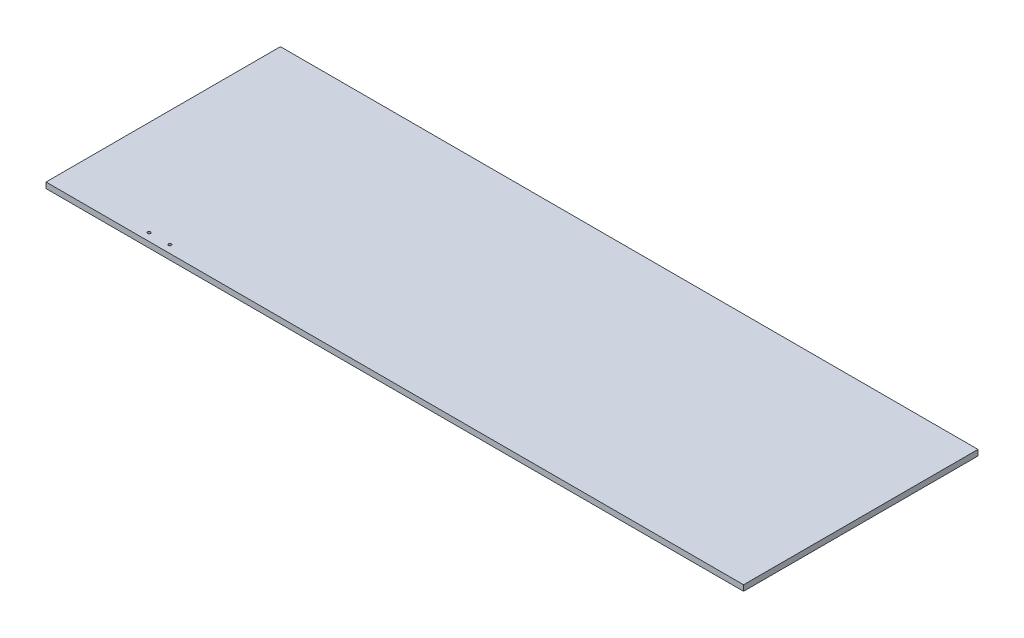
ISO-10303-21;
HEADER;
FILE_DESCRIPTION(('STEP AP214'),'2;1');
FILE_NAME('part.step','',(''),(''),'','','');
FILE_SCHEMA(('AUTOMOTIVE_DESIGN { 1 0 10303 214 1 1 1 1 }'));
ENDSEC;
DATA;
#1=APPLICATION_CONTEXT('core data for automotive mechanical design processes');
#2=APPLICATION_PROTOCOL_DEFINITION('international standard','automotive_design',2000,#1);
#3=PRODUCT_CONTEXT('',#1,'mechanical');
#4=PRODUCT('Part','Part','',(#3));
#5=PRODUCT_RELATED_PRODUCT_CATEGORY('part','',(#4));
#6=PRODUCT_DEFINITION_FORMATION('','',#4);
#7=PRODUCT_DEFINITION_CONTEXT('part definition',#1,'design');
#8=PRODUCT_DEFINITION('design','',#6,#7);
#9=PRODUCT_DEFINITION_SHAPE('','',#8);
#10=(LENGTH_UNIT() NAMED_UNIT(*) SI_UNIT(.MILLI.,.METRE.));
#11=(NAMED_UNIT(*) PLANE_ANGLE_UNIT() SI_UNIT($,.RADIAN.));
#12=(NAMED_UNIT(*) SI_UNIT($,.STERADIAN.) SOLID_ANGLE_UNIT());
#13=UNCERTAINTY_MEASURE_WITH_UNIT(LENGTH_MEASURE(1.E-05),#10,'distance_accuracy_value','');
#14=(GEOMETRIC_REPRESENTATION_CONTEXT(3) GLOBAL_UNCERTAINTY_ASSIGNED_CONTEXT((#13)) GLOBAL_UNIT_ASSIGNED_CONTEXT((#10,
#11,#12)) REPRESENTATION_CONTEXT('',''));
#15=CARTESIAN_POINT('',(0.,0.,0.));
#16=DIRECTION('',(0.,0.,1.));
#17=DIRECTION('',(1.,0.,0.));
#18=AXIS2_PLACEMENT_3D('',#15,#16,#17);
#19=CARTESIAN_POINT('',(0.,10.,-410.));
#20=DIRECTION('',(0.,0.,-1.));
#21=DIRECTION('',(-1.,0.,0.));
#22=AXIS2_PLACEMENT_3D('',#19,#20,#21);
#23=PLANE('',#22);
#24=DIRECTION('',(1.,0.,0.));
#25=VECTOR('',#24,1.);
#26=CARTESIAN_POINT('',(0.,0.,-410.));
#27=LINE('',#26,#25);
#28=CARTESIAN_POINT('',(0.,0.,-410.));
#29=VERTEX_POINT('',#28);
#30=CARTESIAN_POINT('',(1220.,0.,-410.));
#31=VERTEX_POINT('',#30);
#32=EDGE_CURVE('E99',#29,#31,#27,.T.);
#33=ORIENTED_EDGE('',*,*,#32,.F.);
#34=DIRECTION('',(0.,-1.,0.));
#35=VECTOR('',#34,1.);
#36=CARTESIAN_POINT('',(0.,10.,-410.));
#37=LINE('',#36,#35);
#38=CARTESIAN_POINT('',(0.,10.,-410.));
#39=VERTEX_POINT('',#38);
#40=EDGE_CURVE('E11',#39,#29,#37,.T.);
#41=ORIENTED_EDGE('',*,*,#40,.F.);
#42=DIRECTION('',(1.,0.,0.));
#43=VECTOR('',#42,1.);
#44=CARTESIAN_POINT('',(0.,10.,-410.));
#45=LINE('',#44,#43);
#46=CARTESIAN_POINT('',(1220.,10.,-410.));
#47=VERTEX_POINT('',#46);
#48=EDGE_CURVE('E93',#39,#47,#45,.T.);
#49=ORIENTED_EDGE('',*,*,#48,.T.);
#50=DIRECTION('',(0.,-1.,0.));
#51=VECTOR('',#50,1.);
#52=CARTESIAN_POINT('',(1220.,10.,-410.));
#53=LINE('',#52,#51);
#54=EDGE_CURVE('E36',#47,#31,#53,.T.);
#55=ORIENTED_EDGE('',*,*,#54,.T.);
#56=EDGE_LOOP('',(#33,#41,#49,#55));
#57=FACE_BOUND('',#56,.T.);
#58=ADVANCED_FACE('F33',(#57),#23,.T.);
#59=CARTESIAN_POINT('',(0.,10.,-410.));
#60=DIRECTION('',(1.,0.,0.));
#61=DIRECTION('',(0.,0.,-1.));
#62=AXIS2_PLACEMENT_3D('',#59,#60,#61);
#63=PLANE('',#62);
#64=DIRECTION('',(0.,0.,1.));
#65=VECTOR('',#64,1.);
#66=CARTESIAN_POINT('',(0.,0.,-410.));
#67=LINE('',#66,#65);
#68=CARTESIAN_POINT('',(0.,0.,0.));
#69=VERTEX_POINT('',#68);
#70=EDGE_CURVE('E66',#29,#69,#67,.T.);
#71=ORIENTED_EDGE('',*,*,#70,.T.);
#72=DIRECTION('',(0.,-1.,0.));
#73=VECTOR('',#72,1.);
#74=CARTESIAN_POINT('',(0.,10.,0.));
#75=LINE('',#74,#73);
#76=CARTESIAN_POINT('',(0.,10.,0.));
#77=VERTEX_POINT('',#76);
#78=EDGE_CURVE('E42',#77,#69,#75,.T.);
#79=ORIENTED_EDGE('',*,*,#78,.F.);
#80=DIRECTION('',(0.,0.,1.));
#81=VECTOR('',#80,1.);
#82=CARTESIAN_POINT('',(0.,10.,-410.));
#83=LINE('',#82,#81);
#84=EDGE_CURVE('E83',#39,#77,#83,.T.);
#85=ORIENTED_EDGE('',*,*,#84,.F.);
#86=ORIENTED_EDGE('',*,*,#40,.T.);
#87=EDGE_LOOP('',(#71,#79,#85,#86));
#88=FACE_BOUND('',#87,.T.);
#89=ADVANCED_FACE('F110',(#88),#63,.F.);
#90=CARTESIAN_POINT('',(0.,10.,0.));
#91=DIRECTION('',(0.,0.,-1.));
#92=DIRECTION('',(-1.,0.,0.));
#93=AXIS2_PLACEMENT_3D('',#90,#91,#92);
#94=PLANE('',#93);
#95=DIRECTION('',(1.,0.,0.));
#96=VECTOR('',#95,1.);
#97=CARTESIAN_POINT('',(0.,0.,0.));
#98=LINE('',#97,#96);
#99=CARTESIAN_POINT('',(1220.,0.,0.));
#100=VERTEX_POINT('',#99);
#101=EDGE_CURVE('E90',#69,#100,#98,.T.);
#102=ORIENTED_EDGE('',*,*,#101,.T.);
#103=DIRECTION('',(0.,-1.,0.));
#104=VECTOR('',#103,1.);
#105=CARTESIAN_POINT('',(1220.,10.,0.));
#106=LINE('',#105,#104);
#107=CARTESIAN_POINT('',(1220.,10.,0.));
#108=VERTEX_POINT('',#107);
#109=EDGE_CURVE('E87',#108,#100,#106,.T.);
#110=ORIENTED_EDGE('',*,*,#109,.F.);
#111=DIRECTION('',(1.,0.,0.));
#112=VECTOR('',#111,1.);
#113=CARTESIAN_POINT('',(0.,10.,0.));
#114=LINE('',#113,#112);
#115=EDGE_CURVE('E78',#77,#108,#114,.T.);
#116=ORIENTED_EDGE('',*,*,#115,.F.);
#117=ORIENTED_EDGE('',*,*,#78,.T.);
#118=EDGE_LOOP('',(#102,#110,#116,#117));
#119=FACE_BOUND('',#118,.T.);
#120=ADVANCED_FACE('F88',(#119),#94,.F.);
#121=CARTESIAN_POINT('',(1220.,10.,-410.));
#122=DIRECTION('',(1.,0.,0.));
#123=DIRECTION('',(0.,0.,-1.));
#124=AXIS2_PLACEMENT_3D('',#121,#122,#123);
#125=PLANE('',#124);
#126=DIRECTION('',(0.,0.,1.));
#127=VECTOR('',#126,1.);
#128=CARTESIAN_POINT('',(1220.,0.,-410.));
#129=LINE('',#128,#127);
#130=EDGE_CURVE('E102',#31,#100,#129,.T.);
#131=ORIENTED_EDGE('',*,*,#130,.F.);
#132=ORIENTED_EDGE('',*,*,#54,.F.);
#133=DIRECTION('',(0.,0.,1.));
#134=VECTOR('',#133,1.);
#135=CARTESIAN_POINT('',(1220.,10.,-410.));
#136=LINE('',#135,#134);
#137=EDGE_CURVE('E82',#47,#108,#136,.T.);
#138=ORIENTED_EDGE('',*,*,#137,.T.);
#139=ORIENTED_EDGE('',*,*,#109,.T.);
#140=EDGE_LOOP('',(#131,#132,#138,#139));
#141=FACE_BOUND('',#140,.T.);
#142=ADVANCED_FACE('F92',(#141),#125,.T.);
#143=CARTESIAN_POINT('',(0.,10.,0.));
#144=DIRECTION('',(0.,-1.,0.));
#145=DIRECTION('',(0.,0.,-1.));
#146=AXIS2_PLACEMENT_3D('',#143,#144,#145);
#147=PLANE('',#146);
#148=CARTESIAN_POINT('',(166.8,10.,-13.5));
#149=DIRECTION('',(0.,1.,0.));
#150=DIRECTION('',(0.,0.,1.));
#151=AXIS2_PLACEMENT_3D('',#148,#149,#150);
#152=CIRCLE('',#151,2.5);
#153=CARTESIAN_POINT('',(166.8,10.,-11.));
#154=VERTEX_POINT('',#153);
#155=EDGE_CURVE('E103',#154,#154,#152,.T.);
#156=ORIENTED_EDGE('',*,*,#155,.F.);
#157=EDGE_LOOP('',(#156));
#158=FACE_BOUND('',#157,.T.);
#159=CARTESIAN_POINT('',(203.3,10.,-13.5));
#160=DIRECTION('',(0.,1.,0.));
#161=DIRECTION('',(0.,0.,1.));
#162=AXIS2_PLACEMENT_3D('',#159,#160,#161);
#163=CIRCLE('',#162,2.5);
#164=CARTESIAN_POINT('',(203.3,10.,-11.));
#165=VERTEX_POINT('',#164);
#166=EDGE_CURVE('E147',#165,#165,#163,.T.);
#167=ORIENTED_EDGE('',*,*,#166,.F.);
#168=EDGE_LOOP('',(#167));
#169=FACE_BOUND('',#168,.T.);
#170=ORIENTED_EDGE('',*,*,#48,.F.);
#171=ORIENTED_EDGE('',*,*,#84,.T.);
#172=ORIENTED_EDGE('',*,*,#115,.T.);
#173=ORIENTED_EDGE('',*,*,#137,.F.);
#174=EDGE_LOOP('',(#170,#171,#172,#173));
#175=FACE_BOUND('',#174,.T.);
#176=ADVANCED_FACE('F81',(#158,#169,#175),#147,.F.);
#177=CARTESIAN_POINT('',(0.,0.,0.));
#178=DIRECTION('',(0.,-1.,0.));
#179=DIRECTION('',(0.,0.,-1.));
#180=AXIS2_PLACEMENT_3D('',#177,#178,#179);
#181=PLANE('',#180);
#182=CARTESIAN_POINT('',(166.8,0.,-13.5));
#183=DIRECTION('',(0.,1.,0.));
#184=DIRECTION('',(0.,0.,1.));
#185=AXIS2_PLACEMENT_3D('',#182,#183,#184);
#186=CIRCLE('',#185,2.5);
#187=CARTESIAN_POINT('',(166.8,0.,-11.));
#188=VERTEX_POINT('',#187);
#189=EDGE_CURVE('E146',#188,#188,#186,.T.);
#190=ORIENTED_EDGE('',*,*,#189,.T.);
#191=EDGE_LOOP('',(#190));
#192=FACE_BOUND('',#191,.T.);
#193=CARTESIAN_POINT('',(203.3,0.,-13.5));
#194=DIRECTION('',(0.,1.,0.));
#195=DIRECTION('',(0.,0.,1.));
#196=AXIS2_PLACEMENT_3D('',#193,#194,#195);
#197=CIRCLE('',#196,2.5);
#198=CARTESIAN_POINT('',(203.3,0.,-11.));
#199=VERTEX_POINT('',#198);
#200=EDGE_CURVE('E151',#199,#199,#197,.T.);
#201=ORIENTED_EDGE('',*,*,#200,.T.);
#202=EDGE_LOOP('',(#201));
#203=FACE_BOUND('',#202,.T.);
#204=ORIENTED_EDGE('',*,*,#32,.T.);
#205=ORIENTED_EDGE('',*,*,#130,.T.);
#206=ORIENTED_EDGE('',*,*,#101,.F.);
#207=ORIENTED_EDGE('',*,*,#70,.F.);
#208=EDGE_LOOP('',(#204,#205,#206,#207));
#209=FACE_BOUND('',#208,.T.);
#210=ADVANCED_FACE('F108',(#192,#203,#209),#181,.T.);
#211=CARTESIAN_POINT('',(203.3,10.,-13.5));
#212=DIRECTION('',(0.,-1.,0.));
#213=DIRECTION('',(0.,0.,-1.));
#214=AXIS2_PLACEMENT_3D('',#211,#212,#213);
#215=CYLINDRICAL_SURFACE('',#214,2.5);
#216=ORIENTED_EDGE('',*,*,#166,.T.);
#217=EDGE_LOOP('',(#216));
#218=FACE_BOUND('',#217,.T.);
#219=ORIENTED_EDGE('',*,*,#200,.F.);
#220=EDGE_LOOP('',(#219));
#221=FACE_BOUND('',#220,.T.);
#222=ADVANCED_FACE('F129',(#218,#221),#215,.F.);
#223=CARTESIAN_POINT('',(166.8,10.,-13.5));
#224=DIRECTION('',(0.,-1.,0.));
#225=DIRECTION('',(0.,0.,-1.));
#226=AXIS2_PLACEMENT_3D('',#223,#224,#225);
#227=CYLINDRICAL_SURFACE('',#226,2.5);
#228=ORIENTED_EDGE('',*,*,#155,.T.);
#229=EDGE_LOOP('',(#228));
#230=FACE_BOUND('',#229,.T.);
#231=ORIENTED_EDGE('',*,*,#189,.F.);
#232=EDGE_LOOP('',(#231));
#233=FACE_BOUND('',#232,.T.);
#234=ADVANCED_FACE('F136',(#230,#233),#227,.F.);
#235=CLOSED_SHELL('',(#58,#89,#120,#142,#176,#210,#222,#234));
#236=MANIFOLD_SOLID_BREP('B2',#235);
#237=ADVANCED_BREP_SHAPE_REPRESENTATION('',(#18,#236),#14);
#238=SHAPE_DEFINITION_REPRESENTATION(#9,#237);
ENDSEC;
END-ISO-10303-21;
